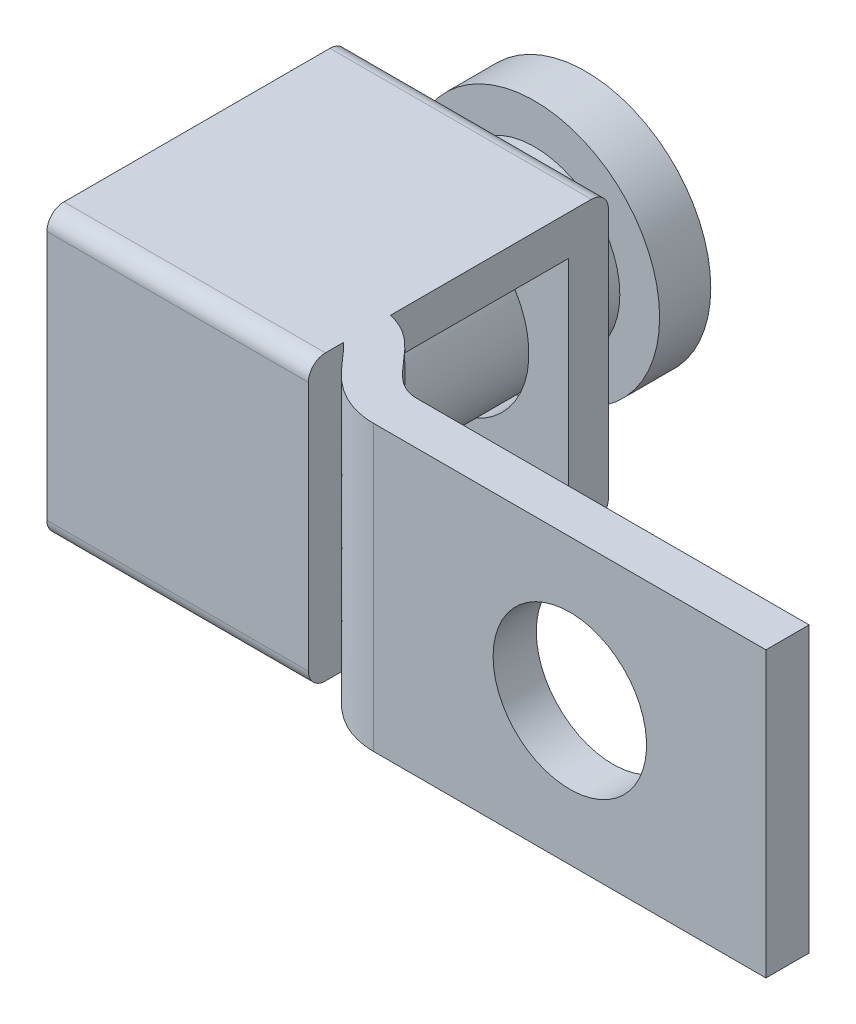
ISO-10303-21;
HEADER;
FILE_DESCRIPTION(('STEP AP214'),'2;1');
FILE_NAME('part.step','',(''),(''),'','','');
FILE_SCHEMA(('AUTOMOTIVE_DESIGN { 1 0 10303 214 1 1 1 1 }'));
ENDSEC;
DATA;
#1=APPLICATION_CONTEXT('core data for automotive mechanical design processes');
#2=APPLICATION_PROTOCOL_DEFINITION('international standard','automotive_design',2000,#1);
#3=PRODUCT_CONTEXT('',#1,'mechanical');
#4=PRODUCT('Part','Part','',(#3));
#5=PRODUCT_RELATED_PRODUCT_CATEGORY('part','',(#4));
#6=PRODUCT_DEFINITION_FORMATION('','',#4);
#7=PRODUCT_DEFINITION_CONTEXT('part definition',#1,'design');
#8=PRODUCT_DEFINITION('design','',#6,#7);
#9=PRODUCT_DEFINITION_SHAPE('','',#8);
#10=(LENGTH_UNIT() NAMED_UNIT(*) SI_UNIT(.MILLI.,.METRE.));
#11=(NAMED_UNIT(*) PLANE_ANGLE_UNIT() SI_UNIT($,.RADIAN.));
#12=(NAMED_UNIT(*) SI_UNIT($,.STERADIAN.) SOLID_ANGLE_UNIT());
#13=UNCERTAINTY_MEASURE_WITH_UNIT(LENGTH_MEASURE(1.E-05),#10,'distance_accuracy_value','');
#14=(GEOMETRIC_REPRESENTATION_CONTEXT(3) GLOBAL_UNCERTAINTY_ASSIGNED_CONTEXT((#13)) GLOBAL_UNIT_ASSIGNED_CONTEXT((#10,
#11,#12)) REPRESENTATION_CONTEXT('',''));
#15=CARTESIAN_POINT('',(0.,0.,0.));
#16=DIRECTION('',(0.,0.,1.));
#17=DIRECTION('',(1.,0.,0.));
#18=AXIS2_PLACEMENT_3D('',#15,#16,#17);
#19=CARTESIAN_POINT('',(-9.652,6.35,-5.5372));
#20=DIRECTION('',(0.,0.,1.));
#21=DIRECTION('',(-1.,0.,0.));
#22=AXIS2_PLACEMENT_3D('',#19,#20,#21);
#23=SPHERICAL_SURFACE('',#22,12.9286);
#24=CARTESIAN_POINT('',(-9.15256939804503,5.83881808976374,-5.5372));
#25=DIRECTION('',(0.698837366630695,-0.715280598786711,0.));
#26=DIRECTION('',(0.715280598786711,0.698837366630695,0.));
#27=AXIS2_PLACEMENT_3D('',#24,#25,#26);
#28=CIRCLE('',#27,12.9088326384874);
#29=CARTESIAN_POINT('',(-12.2827122705762,2.78063252464705,-17.6816500384057));
#30=VERTEX_POINT('',#29);
#31=CARTESIAN_POINT('',(-6.02242652551385,8.89700365488041,-17.6816500384057));
#32=VERTEX_POINT('',#31);
#33=EDGE_CURVE('E54',#30,#32,#28,.T.);
#34=ORIENTED_EDGE('',*,*,#33,.T.);
#35=CARTESIAN_POINT('',(-6.52185712746882,9.40818556511667,-5.5372));
#36=DIRECTION('',(0.715280598786711,0.698837366630695,0.));
#37=DIRECTION('',(-0.698837366630695,0.715280598786711,0.));
#38=AXIS2_PLACEMENT_3D('',#35,#36,#37);
#39=CIRCLE('',#38,12.1654594901653);
#40=CARTESIAN_POINT('',(-7.0212877294238,9.91936747535294,-17.6816500384057));
#41=VERTEX_POINT('',#40);
#42=EDGE_CURVE('E12',#32,#41,#39,.T.);
#43=ORIENTED_EDGE('',*,*,#42,.T.);
#44=CARTESIAN_POINT('',(-10.151430601955,6.86118191023626,-5.5372));
#45=DIRECTION('',(-0.698837366630695,0.715280598786711,0.));
#46=DIRECTION('',(-0.715280598786711,-0.698837366630695,0.));
#47=AXIS2_PLACEMENT_3D('',#44,#45,#46);
#48=CIRCLE('',#47,12.9088326384874);
#49=CARTESIAN_POINT('',(-13.2815734744862,3.80299634511958,-17.6816500384057));
#50=VERTEX_POINT('',#49);
#51=EDGE_CURVE('E88',#41,#50,#48,.T.);
#52=ORIENTED_EDGE('',*,*,#51,.T.);
#53=CARTESIAN_POINT('',(-12.7821428725312,3.29181443488332,-5.5372));
#54=DIRECTION('',(-0.715280598786711,-0.698837366630695,0.));
#55=DIRECTION('',(0.698837366630695,-0.715280598786711,0.));
#56=AXIS2_PLACEMENT_3D('',#53,#54,#55);
#57=CIRCLE('',#56,12.1654594901653);
#58=EDGE_CURVE('E125',#50,#30,#57,.T.);
#59=ORIENTED_EDGE('',*,*,#58,.T.);
#60=EDGE_LOOP('',(#34,#43,#52,#59));
#61=FACE_BOUND('',#60,.T.);
#62=CARTESIAN_POINT('',(-9.652,6.35,-17.1958));
#63=DIRECTION('',(0.,0.,1.));
#64=DIRECTION('',(1.,0.,0.));
#65=AXIS2_PLACEMENT_3D('',#62,#63,#64);
#66=CIRCLE('',#65,5.588);
#67=CARTESIAN_POINT('',(-4.06400000000001,6.35,-17.1958));
#68=VERTEX_POINT('',#67);
#69=EDGE_CURVE('E121',#68,#68,#66,.T.);
#70=ORIENTED_EDGE('',*,*,#69,.F.);
#71=EDGE_LOOP('',(#70));
#72=FACE_BOUND('',#71,.T.);
#73=ADVANCED_FACE('F47',(#61,#72),#23,.T.);
#74=CARTESIAN_POINT('',(-9.652,6.35,-10.8039232284796));
#75=DIRECTION('',(0.,0.,1.));
#76=DIRECTION('',(1.,0.,0.));
#77=AXIS2_PLACEMENT_3D('',#74,#75,#76);
#78=CYLINDRICAL_SURFACE('',#77,5.588);
#79=ORIENTED_EDGE('',*,*,#69,.T.);
#80=EDGE_LOOP('',(#79));
#81=FACE_BOUND('',#80,.T.);
#82=CARTESIAN_POINT('',(-9.652,6.35,-14.9098));
#83=DIRECTION('',(0.,0.,1.));
#84=DIRECTION('',(1.,0.,0.));
#85=AXIS2_PLACEMENT_3D('',#82,#83,#84);
#86=CIRCLE('',#85,5.588);
#87=CARTESIAN_POINT('',(-4.06400000000001,6.35,-14.9098));
#88=VERTEX_POINT('',#87);
#89=EDGE_CURVE('E118',#88,#88,#86,.T.);
#90=ORIENTED_EDGE('',*,*,#89,.F.);
#91=EDGE_LOOP('',(#90));
#92=FACE_BOUND('',#91,.T.);
#93=ADVANCED_FACE('F144',(#81,#92),#78,.T.);
#94=CARTESIAN_POINT('',(0.,6.35,-14.9098));
#95=DIRECTION('',(0.,0.,1.));
#96=DIRECTION('',(1.,0.,0.));
#97=AXIS2_PLACEMENT_3D('',#94,#95,#96);
#98=PLANE('',#97);
#99=ORIENTED_EDGE('',*,*,#89,.T.);
#100=EDGE_LOOP('',(#99));
#101=FACE_BOUND('',#100,.T.);
#102=CARTESIAN_POINT('',(-9.652,6.35,-14.9098));
#103=DIRECTION('',(0.,0.,1.));
#104=DIRECTION('',(1.,0.,0.));
#105=AXIS2_PLACEMENT_3D('',#102,#103,#104);
#106=CIRCLE('',#105,3.81);
#107=CARTESIAN_POINT('',(-5.842,6.35,-14.9098));
#108=VERTEX_POINT('',#107);
#109=EDGE_CURVE('E115',#108,#108,#106,.T.);
#110=ORIENTED_EDGE('',*,*,#109,.F.);
#111=EDGE_LOOP('',(#110));
#112=FACE_BOUND('',#111,.T.);
#113=ADVANCED_FACE('F148',(#101,#112),#98,.T.);
#114=CARTESIAN_POINT('',(-9.652,6.35,-10.8039232284796));
#115=DIRECTION('',(0.,0.,1.));
#116=DIRECTION('',(1.,0.,0.));
#117=AXIS2_PLACEMENT_3D('',#114,#115,#116);
#118=CYLINDRICAL_SURFACE('',#117,3.81);
#119=ORIENTED_EDGE('',*,*,#109,.T.);
#120=EDGE_LOOP('',(#119));
#121=FACE_BOUND('',#120,.T.);
#122=CARTESIAN_POINT('',(-9.652,6.35,-5.207));
#123=DIRECTION('',(0.,0.,1.));
#124=DIRECTION('',(1.,0.,0.));
#125=AXIS2_PLACEMENT_3D('',#122,#123,#124);
#126=CIRCLE('',#125,3.81);
#127=CARTESIAN_POINT('',(-5.842,6.35,-5.207));
#128=VERTEX_POINT('',#127);
#129=EDGE_CURVE('E109',#128,#128,#126,.T.);
#130=ORIENTED_EDGE('',*,*,#129,.F.);
#131=EDGE_LOOP('',(#130));
#132=FACE_BOUND('',#131,.T.);
#133=ADVANCED_FACE('F153',(#121,#132),#118,.T.);
#134=CARTESIAN_POINT('',(0.,6.35,-5.207));
#135=DIRECTION('',(0.,0.,1.));
#136=DIRECTION('',(1.,0.,0.));
#137=AXIS2_PLACEMENT_3D('',#134,#135,#136);
#138=PLANE('',#137);
#139=ORIENTED_EDGE('',*,*,#129,.T.);
#140=EDGE_LOOP('',(#139));
#141=FACE_BOUND('',#140,.T.);
#142=ADVANCED_FACE('F160',(#141),#138,.T.);
#143=CARTESIAN_POINT('',(-6.02242652551385,8.89700365488041,-19.7358));
#144=DIRECTION('',(0.715280598786711,0.698837366630695,0.));
#145=DIRECTION('',(-0.698837366630695,0.715280598786711,0.));
#146=AXIS2_PLACEMENT_3D('',#143,#144,#145);
#147=PLANE('',#146);
#148=DIRECTION('',(0.,0.,1.));
#149=VECTOR('',#148,1.);
#150=CARTESIAN_POINT('',(-6.02242652551385,8.89700365488041,-19.7358));
#151=LINE('',#150,#149);
#152=CARTESIAN_POINT('',(-6.02242652551385,8.89700365488041,-17.1958));
#153=VERTEX_POINT('',#152);
#154=EDGE_CURVE('E103',#32,#153,#151,.T.);
#155=ORIENTED_EDGE('',*,*,#154,.T.);
#156=DIRECTION('',(-0.698837366630695,0.715280598786711,0.));
#157=VECTOR('',#156,1.);
#158=CARTESIAN_POINT('',(-6.02242652551385,8.89700365488041,-17.1958));
#159=LINE('',#158,#157);
#160=CARTESIAN_POINT('',(-7.02128772942379,9.91936747535294,-17.1958));
#161=VERTEX_POINT('',#160);
#162=EDGE_CURVE('E97',#153,#161,#159,.T.);
#163=ORIENTED_EDGE('',*,*,#162,.T.);
#164=DIRECTION('',(0.,0.,1.));
#165=VECTOR('',#164,1.);
#166=CARTESIAN_POINT('',(-7.02128772942379,9.91936747535294,-19.7358));
#167=LINE('',#166,#165);
#168=EDGE_CURVE('E83',#41,#161,#167,.T.);
#169=ORIENTED_EDGE('',*,*,#168,.F.);
#170=ORIENTED_EDGE('',*,*,#42,.F.);
#171=EDGE_LOOP('',(#155,#163,#169,#170));
#172=FACE_BOUND('',#171,.T.);
#173=ADVANCED_FACE('F102',(#172),#147,.F.);
#174=CARTESIAN_POINT('',(-6.02242652551385,8.89700365488041,-19.7358));
#175=DIRECTION('',(0.698837366630695,-0.715280598786711,0.));
#176=DIRECTION('',(0.715280598786711,0.698837366630695,0.));
#177=AXIS2_PLACEMENT_3D('',#174,#175,#176);
#178=PLANE('',#177);
#179=DIRECTION('',(0.,0.,1.));
#180=VECTOR('',#179,1.);
#181=CARTESIAN_POINT('',(-12.2827122705762,2.78063252464705,-19.7358));
#182=LINE('',#181,#180);
#183=CARTESIAN_POINT('',(-12.2827122705762,2.78063252464705,-17.1958));
#184=VERTEX_POINT('',#183);
#185=EDGE_CURVE('E110',#30,#184,#182,.T.);
#186=ORIENTED_EDGE('',*,*,#185,.T.);
#187=DIRECTION('',(0.715280598786711,0.698837366630695,0.));
#188=VECTOR('',#187,1.);
#189=CARTESIAN_POINT('',(-6.02242652551385,8.89700365488041,-17.1958));
#190=LINE('',#189,#188);
#191=EDGE_CURVE('E90',#184,#153,#190,.T.);
#192=ORIENTED_EDGE('',*,*,#191,.T.);
#193=ORIENTED_EDGE('',*,*,#154,.F.);
#194=ORIENTED_EDGE('',*,*,#33,.F.);
#195=EDGE_LOOP('',(#186,#192,#193,#194));
#196=FACE_BOUND('',#195,.T.);
#197=ADVANCED_FACE('F132',(#196),#178,.F.);
#198=CARTESIAN_POINT('',(-12.2827122705762,2.78063252464705,-19.7358));
#199=DIRECTION('',(-0.715280598786711,-0.698837366630695,0.));
#200=DIRECTION('',(0.698837366630695,-0.715280598786711,0.));
#201=AXIS2_PLACEMENT_3D('',#198,#199,#200);
#202=PLANE('',#201);
#203=DIRECTION('',(0.,0.,1.));
#204=VECTOR('',#203,1.);
#205=CARTESIAN_POINT('',(-13.2815734744862,3.80299634511958,-19.7358));
#206=LINE('',#205,#204);
#207=CARTESIAN_POINT('',(-13.2815734744862,3.80299634511958,-17.1958));
#208=VERTEX_POINT('',#207);
#209=EDGE_CURVE('E61',#50,#208,#206,.T.);
#210=ORIENTED_EDGE('',*,*,#209,.T.);
#211=DIRECTION('',(0.698837366630694,-0.715280598786711,0.));
#212=VECTOR('',#211,1.);
#213=CARTESIAN_POINT('',(-12.2827122705762,2.78063252464705,-17.1958));
#214=LINE('',#213,#212);
#215=EDGE_CURVE('E100',#208,#184,#214,.T.);
#216=ORIENTED_EDGE('',*,*,#215,.T.);
#217=ORIENTED_EDGE('',*,*,#185,.F.);
#218=ORIENTED_EDGE('',*,*,#58,.F.);
#219=EDGE_LOOP('',(#210,#216,#217,#218));
#220=FACE_BOUND('',#219,.T.);
#221=ADVANCED_FACE('F134',(#220),#202,.F.);
#222=CARTESIAN_POINT('',(-7.02128772942379,9.91936747535294,-19.7358));
#223=DIRECTION('',(-0.698837366630695,0.715280598786711,0.));
#224=DIRECTION('',(-0.715280598786711,-0.698837366630695,0.));
#225=AXIS2_PLACEMENT_3D('',#222,#223,#224);
#226=PLANE('',#225);
#227=ORIENTED_EDGE('',*,*,#168,.T.);
#228=DIRECTION('',(-0.715280598786711,-0.698837366630695,0.));
#229=VECTOR('',#228,1.);
#230=CARTESIAN_POINT('',(-7.02128772942379,9.91936747535294,-17.1958));
#231=LINE('',#230,#229);
#232=EDGE_CURVE('E86',#161,#208,#231,.T.);
#233=ORIENTED_EDGE('',*,*,#232,.T.);
#234=ORIENTED_EDGE('',*,*,#209,.F.);
#235=ORIENTED_EDGE('',*,*,#51,.F.);
#236=EDGE_LOOP('',(#227,#233,#234,#235));
#237=FACE_BOUND('',#236,.T.);
#238=ADVANCED_FACE('F85',(#237),#226,.F.);
#239=CARTESIAN_POINT('',(0.,0.,-17.1958));
#240=DIRECTION('',(0.,0.,1.));
#241=DIRECTION('',(1.,0.,0.));
#242=AXIS2_PLACEMENT_3D('',#239,#240,#241);
#243=PLANE('',#242);
#244=ORIENTED_EDGE('',*,*,#162,.F.);
#245=ORIENTED_EDGE('',*,*,#191,.F.);
#246=ORIENTED_EDGE('',*,*,#215,.F.);
#247=ORIENTED_EDGE('',*,*,#232,.F.);
#248=EDGE_LOOP('',(#244,#245,#246,#247));
#249=FACE_BOUND('',#248,.T.);
#250=ADVANCED_FACE('F95',(#249),#243,.F.);
#251=CLOSED_SHELL('',(#73,#93,#113,#133,#142,#173,#197,#221,#238,#250));
#252=MANIFOLD_SOLID_BREP('B2',#251);
#253=CARTESIAN_POINT('',(-4.06400000000001,12.7,-2.667));
#254=CARTESIAN_POINT('',(-1.89990278656491,12.7,-2.40887158883268));
#255=CARTESIAN_POINT('',(-1.60244826873078,12.7,0.));
#256=CARTESIAN_POINT('',(0.,12.7,0.));
#257=B_SPLINE_CURVE_WITH_KNOTS('',3,(#253,#254,#255,#256),.UNSPECIFIED.,.F.,.F.,(4,4),(0.,1.),.UNSPECIFIED.);
#258=DIRECTION('',(0.,-1.,0.));
#259=VECTOR('',#258,1.);
#260=SURFACE_OF_LINEAR_EXTRUSION('',#257,#259);
#261=CARTESIAN_POINT('',(-4.06400000000001,0.,-2.667));
#262=CARTESIAN_POINT('',(-1.89990278656491,0.,-2.40887158883268));
#263=CARTESIAN_POINT('',(-1.60244826873078,0.,0.));
#264=CARTESIAN_POINT('',(0.,0.,0.));
#265=B_SPLINE_CURVE_WITH_KNOTS('',3,(#261,#262,#263,#264),.UNSPECIFIED.,.F.,.F.,(4,4),(0.,1.),.UNSPECIFIED.);
#266=CARTESIAN_POINT('',(-3.81,0.,-2.62534928328078));
#267=VERTEX_POINT('',#266);
#268=CARTESIAN_POINT('',(0.,0.,0.));
#269=VERTEX_POINT('',#268);
#270=EDGE_CURVE('E569',#267,#269,#265,.T.);
#271=ORIENTED_EDGE('',*,*,#270,.F.);
#272=DIRECTION('',(0.,-1.,0.));
#273=VECTOR('',#272,1.);
#274=CARTESIAN_POINT('',(-3.81,12.7,-2.62534928131849));
#275=LINE('',#274,#273);
#276=CARTESIAN_POINT('',(-3.81,1.778,-2.62534928328078));
#277=VERTEX_POINT('',#276);
#278=EDGE_CURVE('E423',#267,#277,#275,.F.);
#279=ORIENTED_EDGE('',*,*,#278,.T.);
#280=CARTESIAN_POINT('',(-4.06400000000001,1.778,-2.667));
#281=CARTESIAN_POINT('',(-1.89990278656491,1.778,-2.40887158883268));
#282=CARTESIAN_POINT('',(-1.60244826873078,1.778,0.));
#283=CARTESIAN_POINT('',(0.,1.778,0.));
#284=B_SPLINE_CURVE_WITH_KNOTS('',3,(#280,#281,#282,#283),.UNSPECIFIED.,.F.,.F.,(4,4),(0.,1.),.UNSPECIFIED.);
#285=CARTESIAN_POINT('',(-4.06400000000001,1.778,-2.667));
#286=VERTEX_POINT('',#285);
#287=EDGE_CURVE('E383',#277,#286,#284,.F.);
#288=ORIENTED_EDGE('',*,*,#287,.T.);
#289=DIRECTION('',(0.,-1.,0.));
#290=VECTOR('',#289,1.);
#291=CARTESIAN_POINT('',(-4.06400000000001,12.7,-2.667));
#292=LINE('',#291,#290);
#293=CARTESIAN_POINT('',(-4.06400000000001,10.922,-2.667));
#294=VERTEX_POINT('',#293);
#295=EDGE_CURVE('E550',#294,#286,#292,.T.);
#296=ORIENTED_EDGE('',*,*,#295,.F.);
#297=CARTESIAN_POINT('',(-4.06400000000001,10.922,-2.667));
#298=CARTESIAN_POINT('',(-1.89990278656491,10.922,-2.40887158883268));
#299=CARTESIAN_POINT('',(-1.60244826873078,10.922,0.));
#300=CARTESIAN_POINT('',(0.,10.922,0.));
#301=B_SPLINE_CURVE_WITH_KNOTS('',3,(#297,#298,#299,#300),.UNSPECIFIED.,.F.,.F.,(4,4),(0.,1.),.UNSPECIFIED.);
#302=CARTESIAN_POINT('',(-3.81,10.922,-2.62534928328078));
#303=VERTEX_POINT('',#302);
#304=EDGE_CURVE('E427',#294,#303,#301,.T.);
#305=ORIENTED_EDGE('',*,*,#304,.T.);
#306=CARTESIAN_POINT('',(-3.81,12.7,-2.62534928328078));
#307=VERTEX_POINT('',#306);
#308=EDGE_CURVE('E420',#303,#307,#275,.F.);
#309=ORIENTED_EDGE('',*,*,#308,.T.);
#310=CARTESIAN_POINT('',(0.,12.7,0.));
#311=VERTEX_POINT('',#310);
#312=EDGE_CURVE('E460',#307,#311,#257,.T.);
#313=ORIENTED_EDGE('',*,*,#312,.T.);
#314=DIRECTION('',(0.,-1.,0.));
#315=VECTOR('',#314,1.);
#316=CARTESIAN_POINT('',(0.,12.7,0.));
#317=LINE('',#316,#315);
#318=EDGE_CURVE('E547',#311,#269,#317,.T.);
#319=ORIENTED_EDGE('',*,*,#318,.T.);
#320=EDGE_LOOP('',(#271,#279,#288,#296,#305,#309,#313,#319));
#321=FACE_BOUND('',#320,.T.);
#322=ADVANCED_FACE('F234',(#321),#260,.T.);
#323=CARTESIAN_POINT('',(-15.494,12.7,-2.667));
#324=DIRECTION('',(0.,0.,-1.));
#325=DIRECTION('',(-1.,0.,0.));
#326=AXIS2_PLACEMENT_3D('',#323,#324,#325);
#327=PLANE('',#326);
#328=ORIENTED_EDGE('',*,*,#295,.T.);
#329=DIRECTION('',(-1.,0.,0.));
#330=VECTOR('',#329,1.);
#331=CARTESIAN_POINT('',(-15.494,1.778,-2.667));
#332=LINE('',#331,#330);
#333=CARTESIAN_POINT('',(-15.494,1.778,-2.667));
#334=VERTEX_POINT('',#333);
#335=EDGE_CURVE('E432',#286,#334,#332,.T.);
#336=ORIENTED_EDGE('',*,*,#335,.T.);
#337=DIRECTION('',(0.,-1.,0.));
#338=VECTOR('',#337,1.);
#339=CARTESIAN_POINT('',(-15.494,12.7,-2.667));
#340=LINE('',#339,#338);
#341=CARTESIAN_POINT('',(-15.494,10.922,-2.667));
#342=VERTEX_POINT('',#341);
#343=EDGE_CURVE('E553',#342,#334,#340,.T.);
#344=ORIENTED_EDGE('',*,*,#343,.F.);
#345=DIRECTION('',(1.,0.,0.));
#346=VECTOR('',#345,1.);
#347=CARTESIAN_POINT('',(-15.494,10.922,-2.667));
#348=LINE('',#347,#346);
#349=EDGE_CURVE('E424',#342,#294,#348,.T.);
#350=ORIENTED_EDGE('',*,*,#349,.T.);
#351=EDGE_LOOP('',(#328,#336,#344,#350));
#352=FACE_BOUND('',#351,.T.);
#353=ADVANCED_FACE('F474',(#352),#327,.T.);
#354=CARTESIAN_POINT('',(-4.20884166029546,12.7,-0.736599999999984));
#355=CARTESIAN_POINT('',(-4.13364475246318,12.7,-0.720873402253979));
#356=CARTESIAN_POINT('',(-4.08091764722321,12.7,-0.701195252116462));
#357=CARTESIAN_POINT('',(-3.96659914964292,12.7,-0.643669048456065));
#358=CARTESIAN_POINT('',(-3.90467372036856,12.7,-0.604208310034663));
#359=CARTESIAN_POINT('',(-3.75343510708307,12.7,-0.482014662267737));
#360=CARTESIAN_POINT('',(-3.66523662592699,12.7,-0.399083494241391));
#361=CARTESIAN_POINT('',(-3.46383226136667,12.7,-0.185573469730541));
#362=CARTESIAN_POINT('',(-3.35116983660942,12.7,-0.0554155103947658));
#363=CARTESIAN_POINT('',(-3.09452219515832,12.7,0.244365970775703));
#364=CARTESIAN_POINT('',(-2.95082149851627,12.7,0.414054000680158));
#365=CARTESIAN_POINT('',(-2.60623832854586,12.7,0.780981080871573));
#366=CARTESIAN_POINT('',(-2.40494496817286,12.7,0.97952680959493));
#367=CARTESIAN_POINT('',(-1.89734259380534,12.7,1.37103034480415));
#368=CARTESIAN_POINT('',(-1.58680767852259,12.7,1.56431585092809));
#369=CARTESIAN_POINT('',(-1.03351309697141,12.7,1.77674624108293));
#370=CARTESIAN_POINT('',(-0.835509504566746,12.7,1.8339977794622));
#371=CARTESIAN_POINT('',(-0.424705158929737,12.7,1.91086619655528));
#372=CARTESIAN_POINT('',(-0.212243475326851,12.7,1.9304));
#373=CARTESIAN_POINT('',(0.,12.7,1.9304));
#374=B_SPLINE_CURVE_WITH_KNOTS('',3,(#354,#355,#356,#357,#358,#359,#360,#361,#362,#363,#364,
#365,#366,#367,#368,#369,#370,#371,#372,#373),.UNSPECIFIED.,.F.,.F.,(4,2,2,2,2,2,2,2,2,4),(0.,
0.125,0.25,0.375,0.5,0.625,0.75,0.875,0.9375,1.),.UNSPECIFIED.);
#375=DIRECTION('',(0.,-1.,0.));
#376=VECTOR('',#375,1.);
#377=SURFACE_OF_LINEAR_EXTRUSION('',#374,#376);
#378=DIRECTION('',(0.,-1.,0.));
#379=VECTOR('',#378,1.);
#380=CARTESIAN_POINT('',(-3.81000000000597,12.7,-0.527474915905921));
#381=LINE('',#380,#379);
#382=CARTESIAN_POINT('',(-3.80999999505266,0.,-0.527474911779707));
#383=VERTEX_POINT('',#382);
#384=CARTESIAN_POINT('',(-3.81,12.7,-0.527474911779707));
#385=VERTEX_POINT('',#384);
#386=EDGE_CURVE('E413',#383,#385,#381,.F.);
#387=ORIENTED_EDGE('',*,*,#386,.F.);
#388=CARTESIAN_POINT('',(-4.20884166029546,0.,-0.736599999999984));
#389=CARTESIAN_POINT('',(-4.13364475246318,0.,-0.720873402253979));
#390=CARTESIAN_POINT('',(-4.08091764722321,0.,-0.701195252116462));
#391=CARTESIAN_POINT('',(-3.96659914964292,0.,-0.643669048456065));
#392=CARTESIAN_POINT('',(-3.90467372036856,0.,-0.604208310034663));
#393=CARTESIAN_POINT('',(-3.75343510708307,0.,-0.482014662267737));
#394=CARTESIAN_POINT('',(-3.66523662592699,0.,-0.399083494241391));
#395=CARTESIAN_POINT('',(-3.46383226136667,0.,-0.185573469730541));
#396=CARTESIAN_POINT('',(-3.35116983660942,0.,-0.0554155103947658));
#397=CARTESIAN_POINT('',(-3.09452219515832,0.,0.244365970775703));
#398=CARTESIAN_POINT('',(-2.95082149851627,0.,0.414054000680158));
#399=CARTESIAN_POINT('',(-2.60623832854586,0.,0.780981080871573));
#400=CARTESIAN_POINT('',(-2.40494496817286,0.,0.97952680959493));
#401=CARTESIAN_POINT('',(-1.89734259380534,0.,1.37103034480415));
#402=CARTESIAN_POINT('',(-1.58680767852259,0.,1.56431585092809));
#403=CARTESIAN_POINT('',(-1.03351309697141,0.,1.77674624108293));
#404=CARTESIAN_POINT('',(-0.835509504566746,0.,1.8339977794622));
#405=CARTESIAN_POINT('',(-0.424705158929737,0.,1.91086619655528));
#406=CARTESIAN_POINT('',(-0.212243475326851,0.,1.9304));
#407=CARTESIAN_POINT('',(0.,0.,1.9304));
#408=B_SPLINE_CURVE_WITH_KNOTS('',3,(#388,#389,#390,#391,#392,#393,#394,#395,#396,#397,#398,
#399,#400,#401,#402,#403,#404,#405,#406,#407),.UNSPECIFIED.,.F.,.F.,(4,2,2,2,2,2,2,2,2,4),(0.,
0.125,0.25,0.375,0.5,0.625,0.75,0.875,0.9375,1.),.UNSPECIFIED.);
#409=CARTESIAN_POINT('',(0.,0.,1.9304));
#410=VERTEX_POINT('',#409);
#411=EDGE_CURVE('E454',#383,#410,#408,.T.);
#412=ORIENTED_EDGE('',*,*,#411,.T.);
#413=DIRECTION('',(0.,-1.,0.));
#414=VECTOR('',#413,1.);
#415=CARTESIAN_POINT('',(0.,12.7,1.9304));
#416=LINE('',#415,#414);
#417=CARTESIAN_POINT('',(0.,12.7,1.9304));
#418=VERTEX_POINT('',#417);
#419=EDGE_CURVE('E556',#418,#410,#416,.T.);
#420=ORIENTED_EDGE('',*,*,#419,.F.);
#421=EDGE_CURVE('E559',#385,#418,#374,.T.);
#422=ORIENTED_EDGE('',*,*,#421,.F.);
#423=EDGE_LOOP('',(#387,#412,#420,#422));
#424=FACE_BOUND('',#423,.T.);
#425=ADVANCED_FACE('F489',(#424),#377,.F.);
#426=CARTESIAN_POINT('',(0.,12.7,1.9304));
#427=DIRECTION('',(0.,0.,-1.));
#428=DIRECTION('',(-1.,0.,0.));
#429=AXIS2_PLACEMENT_3D('',#426,#427,#428);
#430=PLANE('',#429);
#431=CARTESIAN_POINT('',(8.763,6.35,1.9304));
#432=DIRECTION('',(0.,0.,-1.));
#433=DIRECTION('',(-1.,0.,0.));
#434=AXIS2_PLACEMENT_3D('',#431,#432,#433);
#435=CIRCLE('',#434,3.429);
#436=CARTESIAN_POINT('',(5.334,6.35,1.9304));
#437=VERTEX_POINT('',#436);
#438=EDGE_CURVE('E447',#437,#437,#435,.T.);
#439=ORIENTED_EDGE('',*,*,#438,.T.);
#440=EDGE_LOOP('',(#439));
#441=FACE_BOUND('',#440,.T.);
#442=DIRECTION('',(1.,0.,0.));
#443=VECTOR('',#442,1.);
#444=CARTESIAN_POINT('',(0.,0.,1.9304));
#445=LINE('',#444,#443);
#446=CARTESIAN_POINT('',(17.526,0.,1.9304));
#447=VERTEX_POINT('',#446);
#448=EDGE_CURVE('E450',#410,#447,#445,.T.);
#449=ORIENTED_EDGE('',*,*,#448,.T.);
#450=DIRECTION('',(0.,-1.,0.));
#451=VECTOR('',#450,1.);
#452=CARTESIAN_POINT('',(17.526,12.7,1.9304));
#453=LINE('',#452,#451);
#454=CARTESIAN_POINT('',(17.526,12.7,1.9304));
#455=VERTEX_POINT('',#454);
#456=EDGE_CURVE('E540',#455,#447,#453,.T.);
#457=ORIENTED_EDGE('',*,*,#456,.F.);
#458=DIRECTION('',(1.,0.,0.));
#459=VECTOR('',#458,1.);
#460=CARTESIAN_POINT('',(0.,12.7,1.9304));
#461=LINE('',#460,#459);
#462=EDGE_CURVE('E451',#418,#455,#461,.T.);
#463=ORIENTED_EDGE('',*,*,#462,.F.);
#464=ORIENTED_EDGE('',*,*,#419,.T.);
#465=EDGE_LOOP('',(#449,#457,#463,#464));
#466=FACE_BOUND('',#465,.T.);
#467=ADVANCED_FACE('F485',(#441,#466),#430,.F.);
#468=CARTESIAN_POINT('',(17.526,12.7,0.));
#469=DIRECTION('',(1.,0.,0.));
#470=DIRECTION('',(0.,0.,-1.));
#471=AXIS2_PLACEMENT_3D('',#468,#469,#470);
#472=PLANE('',#471);
#473=DIRECTION('',(0.,0.,1.));
#474=VECTOR('',#473,1.);
#475=CARTESIAN_POINT('',(17.526,0.,0.));
#476=LINE('',#475,#474);
#477=CARTESIAN_POINT('',(17.526,0.,0.));
#478=VERTEX_POINT('',#477);
#479=EDGE_CURVE('E579',#478,#447,#476,.T.);
#480=ORIENTED_EDGE('',*,*,#479,.F.);
#481=DIRECTION('',(0.,-1.,0.));
#482=VECTOR('',#481,1.);
#483=CARTESIAN_POINT('',(17.526,12.7,0.));
#484=LINE('',#483,#482);
#485=CARTESIAN_POINT('',(17.526,12.7,0.));
#486=VERTEX_POINT('',#485);
#487=EDGE_CURVE('E545',#486,#478,#484,.T.);
#488=ORIENTED_EDGE('',*,*,#487,.F.);
#489=DIRECTION('',(0.,0.,1.));
#490=VECTOR('',#489,1.);
#491=CARTESIAN_POINT('',(17.526,12.7,0.));
#492=LINE('',#491,#490);
#493=EDGE_CURVE('E453',#486,#455,#492,.T.);
#494=ORIENTED_EDGE('',*,*,#493,.T.);
#495=ORIENTED_EDGE('',*,*,#456,.T.);
#496=EDGE_LOOP('',(#480,#488,#494,#495));
#497=FACE_BOUND('',#496,.T.);
#498=ADVANCED_FACE('F481',(#497),#472,.T.);
#499=CARTESIAN_POINT('',(0.,12.7,0.));
#500=DIRECTION('',(0.,0.,-1.));
#501=DIRECTION('',(-1.,0.,0.));
#502=AXIS2_PLACEMENT_3D('',#499,#500,#501);
#503=PLANE('',#502);
#504=CARTESIAN_POINT('',(8.763,6.35,0.));
#505=DIRECTION('',(0.,0.,-1.));
#506=DIRECTION('',(-1.,0.,0.));
#507=AXIS2_PLACEMENT_3D('',#504,#505,#506);
#508=CIRCLE('',#507,3.429);
#509=CARTESIAN_POINT('',(5.334,6.35,0.));
#510=VERTEX_POINT('',#509);
#511=EDGE_CURVE('E441',#510,#510,#508,.T.);
#512=ORIENTED_EDGE('',*,*,#511,.F.);
#513=EDGE_LOOP('',(#512));
#514=FACE_BOUND('',#513,.T.);
#515=DIRECTION('',(1.,0.,0.));
#516=VECTOR('',#515,1.);
#517=CARTESIAN_POINT('',(0.,0.,0.));
#518=LINE('',#517,#516);
#519=EDGE_CURVE('E573',#269,#478,#518,.T.);
#520=ORIENTED_EDGE('',*,*,#519,.F.);
#521=ORIENTED_EDGE('',*,*,#318,.F.);
#522=DIRECTION('',(1.,0.,0.));
#523=VECTOR('',#522,1.);
#524=CARTESIAN_POINT('',(0.,12.7,0.));
#525=LINE('',#524,#523);
#526=EDGE_CURVE('E457',#311,#486,#525,.T.);
#527=ORIENTED_EDGE('',*,*,#526,.T.);
#528=ORIENTED_EDGE('',*,*,#487,.T.);
#529=EDGE_LOOP('',(#520,#521,#527,#528));
#530=FACE_BOUND('',#529,.T.);
#531=ADVANCED_FACE('F477',(#514,#530),#503,.T.);
#532=CARTESIAN_POINT('',(-15.494,12.7,-0.7366));
#533=DIRECTION('',(-1.,0.,0.));
#534=DIRECTION('',(0.,0.,1.));
#535=AXIS2_PLACEMENT_3D('',#532,#533,#534);
#536=PLANE('',#535);
#537=ORIENTED_EDGE('',*,*,#343,.T.);
#538=DIRECTION('',(0.,0.,1.));
#539=VECTOR('',#538,1.);
#540=CARTESIAN_POINT('',(-15.494,1.778,-0.7366));
#541=LINE('',#540,#539);
#542=CARTESIAN_POINT('',(-15.494,1.778,-10.5918));
#543=VERTEX_POINT('',#542);
#544=EDGE_CURVE('E391',#543,#334,#541,.T.);
#545=ORIENTED_EDGE('',*,*,#544,.F.);
#546=DIRECTION('',(0.,-1.,0.));
#547=VECTOR('',#546,1.);
#548=CARTESIAN_POINT('',(-15.494,1.778,-10.5918));
#549=LINE('',#548,#547);
#550=CARTESIAN_POINT('',(-15.494,10.922,-10.5918));
#551=VERTEX_POINT('',#550);
#552=EDGE_CURVE('E373',#551,#543,#549,.T.);
#553=ORIENTED_EDGE('',*,*,#552,.F.);
#554=DIRECTION('',(0.,0.,-1.));
#555=VECTOR('',#554,1.);
#556=CARTESIAN_POINT('',(-15.494,10.922,-0.7366));
#557=LINE('',#556,#555);
#558=EDGE_CURVE('E395',#342,#551,#557,.T.);
#559=ORIENTED_EDGE('',*,*,#558,.F.);
#560=EDGE_LOOP('',(#537,#545,#553,#559));
#561=FACE_BOUND('',#560,.T.);
#562=DIRECTION('',(0.,0.,-1.));
#563=VECTOR('',#562,1.);
#564=CARTESIAN_POINT('',(-15.494,0.,-0.7366));
#565=LINE('',#564,#563);
#566=CARTESIAN_POINT('',(-15.494,0.,0.2794));
#567=VERTEX_POINT('',#566);
#568=CARTESIAN_POINT('',(-15.494,0.,-11.6078));
#569=VERTEX_POINT('',#568);
#570=EDGE_CURVE('E563',#567,#569,#565,.T.);
#571=ORIENTED_EDGE('',*,*,#570,.F.);
#572=CARTESIAN_POINT('',(-15.494,0.762,0.2794));
#573=DIRECTION('',(-1.,0.,0.));
#574=DIRECTION('',(0.,0.,1.));
#575=AXIS2_PLACEMENT_3D('',#572,#573,#574);
#576=CIRCLE('',#575,0.762);
#577=CARTESIAN_POINT('',(-15.494,0.762,1.0414));
#578=VERTEX_POINT('',#577);
#579=EDGE_CURVE('E529',#567,#578,#576,.T.);
#580=ORIENTED_EDGE('',*,*,#579,.T.);
#581=DIRECTION('',(0.,1.,0.));
#582=VECTOR('',#581,1.);
#583=CARTESIAN_POINT('',(-15.494,0.,1.0414));
#584=LINE('',#583,#582);
#585=CARTESIAN_POINT('',(-15.494,11.938,1.0414));
#586=VERTEX_POINT('',#585);
#587=EDGE_CURVE('E376',#578,#586,#584,.T.);
#588=ORIENTED_EDGE('',*,*,#587,.T.);
#589=CARTESIAN_POINT('',(-15.494,11.938,0.2794));
#590=DIRECTION('',(-1.,0.,0.));
#591=DIRECTION('',(0.,0.,1.));
#592=AXIS2_PLACEMENT_3D('',#589,#590,#591);
#593=CIRCLE('',#592,0.762);
#594=CARTESIAN_POINT('',(-15.494,12.7,0.2794));
#595=VERTEX_POINT('',#594);
#596=EDGE_CURVE('E531',#586,#595,#593,.T.);
#597=ORIENTED_EDGE('',*,*,#596,.T.);
#598=DIRECTION('',(0.,0.,-1.));
#599=VECTOR('',#598,1.);
#600=CARTESIAN_POINT('',(-15.494,12.7,-0.7366));
#601=LINE('',#600,#599);
#602=CARTESIAN_POINT('',(-15.494,12.7,-11.6078));
#603=VERTEX_POINT('',#602);
#604=EDGE_CURVE('E465',#595,#603,#601,.T.);
#605=ORIENTED_EDGE('',*,*,#604,.T.);
#606=CARTESIAN_POINT('',(-15.494,11.938,-11.6078));
#607=DIRECTION('',(-1.,0.,0.));
#608=DIRECTION('',(0.,0.,1.));
#609=AXIS2_PLACEMENT_3D('',#606,#607,#608);
#610=CIRCLE('',#609,0.762);
#611=CARTESIAN_POINT('',(-15.494,11.938,-12.3698));
#612=VERTEX_POINT('',#611);
#613=EDGE_CURVE('E534',#603,#612,#610,.T.);
#614=ORIENTED_EDGE('',*,*,#613,.T.);
#615=DIRECTION('',(0.,-1.,0.));
#616=VECTOR('',#615,1.);
#617=CARTESIAN_POINT('',(-15.494,0.,-12.3698));
#618=LINE('',#617,#616);
#619=CARTESIAN_POINT('',(-15.494,0.762,-12.3698));
#620=VERTEX_POINT('',#619);
#621=EDGE_CURVE('E405',#612,#620,#618,.T.);
#622=ORIENTED_EDGE('',*,*,#621,.T.);
#623=CARTESIAN_POINT('',(-15.494,0.762,-11.6078));
#624=DIRECTION('',(-1.,0.,0.));
#625=DIRECTION('',(0.,0.,1.));
#626=AXIS2_PLACEMENT_3D('',#623,#624,#625);
#627=CIRCLE('',#626,0.762);
#628=EDGE_CURVE('E511',#620,#569,#627,.T.);
#629=ORIENTED_EDGE('',*,*,#628,.T.);
#630=EDGE_LOOP('',(#571,#580,#588,#597,#605,#614,#622,#629));
#631=FACE_BOUND('',#630,.T.);
#632=ADVANCED_FACE('F480',(#561,#631),#536,.T.);
#633=CARTESIAN_POINT('',(-1.82138164573589,12.7,-1.23670184581225));
#634=DIRECTION('',(0.,1.,0.));
#635=DIRECTION('',(1.,0.,0.));
#636=AXIS2_PLACEMENT_3D('',#633,#634,#635);
#637=PLANE('',#636);
#638=ORIENTED_EDGE('',*,*,#604,.F.);
#639=DIRECTION('',(-1.,0.,0.));
#640=VECTOR('',#639,1.);
#641=CARTESIAN_POINT('',(-1.82138164573589,12.7,0.2794));
#642=LINE('',#641,#640);
#643=CARTESIAN_POINT('',(-3.81,12.7,0.2794));
#644=VERTEX_POINT('',#643);
#645=EDGE_CURVE('E513',#595,#644,#642,.F.);
#646=ORIENTED_EDGE('',*,*,#645,.T.);
#647=DIRECTION('',(0.,0.,-1.));
#648=VECTOR('',#647,1.);
#649=CARTESIAN_POINT('',(-3.81,12.7,1.0414));
#650=LINE('',#649,#648);
#651=EDGE_CURVE('E406',#644,#385,#650,.T.);
#652=ORIENTED_EDGE('',*,*,#651,.T.);
#653=ORIENTED_EDGE('',*,*,#421,.T.);
#654=ORIENTED_EDGE('',*,*,#462,.T.);
#655=ORIENTED_EDGE('',*,*,#493,.F.);
#656=ORIENTED_EDGE('',*,*,#526,.F.);
#657=ORIENTED_EDGE('',*,*,#312,.F.);
#658=CARTESIAN_POINT('',(-3.81,12.7,-11.6078));
#659=VERTEX_POINT('',#658);
#660=EDGE_CURVE('E404',#307,#659,#650,.T.);
#661=ORIENTED_EDGE('',*,*,#660,.T.);
#662=DIRECTION('',(-1.,0.,0.));
#663=VECTOR('',#662,1.);
#664=CARTESIAN_POINT('',(-1.82138164573589,12.7,-11.6078));
#665=LINE('',#664,#663);
#666=EDGE_CURVE('E517',#659,#603,#665,.T.);
#667=ORIENTED_EDGE('',*,*,#666,.T.);
#668=EDGE_LOOP('',(#638,#646,#652,#653,#654,#655,#656,#657,#661,#667));
#669=FACE_BOUND('',#668,.T.);
#670=ADVANCED_FACE('F596',(#669),#637,.T.);
#671=CARTESIAN_POINT('',(-1.82138164573589,0.,-1.23670184581225));
#672=DIRECTION('',(0.,1.,0.));
#673=DIRECTION('',(1.,0.,0.));
#674=AXIS2_PLACEMENT_3D('',#671,#672,#673);
#675=PLANE('',#674);
#676=DIRECTION('',(0.,0.,1.));
#677=VECTOR('',#676,1.);
#678=CARTESIAN_POINT('',(-3.81,0.,1.0414));
#679=LINE('',#678,#677);
#680=CARTESIAN_POINT('',(-3.81,0.,0.2794));
#681=VERTEX_POINT('',#680);
#682=EDGE_CURVE('E410',#383,#681,#679,.T.);
#683=ORIENTED_EDGE('',*,*,#682,.T.);
#684=DIRECTION('',(-1.,0.,0.));
#685=VECTOR('',#684,1.);
#686=CARTESIAN_POINT('',(-15.494,0.,0.2794));
#687=LINE('',#686,#685);
#688=EDGE_CURVE('E536',#681,#567,#687,.T.);
#689=ORIENTED_EDGE('',*,*,#688,.T.);
#690=ORIENTED_EDGE('',*,*,#570,.T.);
#691=DIRECTION('',(-1.,0.,0.));
#692=VECTOR('',#691,1.);
#693=CARTESIAN_POINT('',(-3.81,0.,-11.6078));
#694=LINE('',#693,#692);
#695=CARTESIAN_POINT('',(-3.81,0.,-11.6078));
#696=VERTEX_POINT('',#695);
#697=EDGE_CURVE('E508',#569,#696,#694,.F.);
#698=ORIENTED_EDGE('',*,*,#697,.T.);
#699=EDGE_CURVE('E411',#696,#267,#679,.T.);
#700=ORIENTED_EDGE('',*,*,#699,.T.);
#701=ORIENTED_EDGE('',*,*,#270,.T.);
#702=ORIENTED_EDGE('',*,*,#519,.T.);
#703=ORIENTED_EDGE('',*,*,#479,.T.);
#704=ORIENTED_EDGE('',*,*,#448,.F.);
#705=ORIENTED_EDGE('',*,*,#411,.F.);
#706=EDGE_LOOP('',(#683,#689,#690,#698,#700,#701,#702,#703,#704,#705));
#707=FACE_BOUND('',#706,.T.);
#708=ADVANCED_FACE('F593',(#707),#675,.F.);
#709=CARTESIAN_POINT('',(8.763,6.35,2.54));
#710=DIRECTION('',(0.,0.,-1.));
#711=DIRECTION('',(-1.,0.,0.));
#712=AXIS2_PLACEMENT_3D('',#709,#710,#711);
#713=CYLINDRICAL_SURFACE('',#712,3.429);
#714=ORIENTED_EDGE('',*,*,#511,.T.);
#715=EDGE_LOOP('',(#714));
#716=FACE_BOUND('',#715,.T.);
#717=ORIENTED_EDGE('',*,*,#438,.F.);
#718=EDGE_LOOP('',(#717));
#719=FACE_BOUND('',#718,.T.);
#720=ADVANCED_FACE('F643',(#716,#719),#713,.F.);
#721=CARTESIAN_POINT('',(-3.81,0.,1.0414));
#722=DIRECTION('',(0.,0.,1.));
#723=DIRECTION('',(1.,0.,0.));
#724=AXIS2_PLACEMENT_3D('',#721,#722,#723);
#725=PLANE('',#724);
#726=ORIENTED_EDGE('',*,*,#587,.F.);
#727=DIRECTION('',(-1.,0.,0.));
#728=VECTOR('',#727,1.);
#729=CARTESIAN_POINT('',(-3.81,0.762,1.0414));
#730=LINE('',#729,#728);
#731=CARTESIAN_POINT('',(-3.81,0.762,1.0414));
#732=VERTEX_POINT('',#731);
#733=EDGE_CURVE('E524',#578,#732,#730,.F.);
#734=ORIENTED_EDGE('',*,*,#733,.T.);
#735=DIRECTION('',(0.,1.,0.));
#736=VECTOR('',#735,1.);
#737=CARTESIAN_POINT('',(-3.81,0.,1.0414));
#738=LINE('',#737,#736);
#739=CARTESIAN_POINT('',(-3.81,11.938,1.0414));
#740=VERTEX_POINT('',#739);
#741=EDGE_CURVE('E401',#732,#740,#738,.T.);
#742=ORIENTED_EDGE('',*,*,#741,.T.);
#743=DIRECTION('',(-1.,0.,0.));
#744=VECTOR('',#743,1.);
#745=CARTESIAN_POINT('',(-3.81,11.938,1.0414));
#746=LINE('',#745,#744);
#747=EDGE_CURVE('E526',#740,#586,#746,.T.);
#748=ORIENTED_EDGE('',*,*,#747,.T.);
#749=EDGE_LOOP('',(#726,#734,#742,#748));
#750=FACE_BOUND('',#749,.T.);
#751=ADVANCED_FACE('F616',(#750),#725,.T.);
#752=CARTESIAN_POINT('',(-3.81,0.,0.));
#753=DIRECTION('',(-1.,0.,0.));
#754=DIRECTION('',(0.,0.,1.));
#755=AXIS2_PLACEMENT_3D('',#752,#753,#754);
#756=PLANE('',#755);
#757=ORIENTED_EDGE('',*,*,#741,.F.);
#758=CARTESIAN_POINT('',(-3.81,0.762,0.2794));
#759=DIRECTION('',(-1.,0.,0.));
#760=DIRECTION('',(0.,0.,1.));
#761=AXIS2_PLACEMENT_3D('',#758,#759,#760);
#762=CIRCLE('',#761,0.762);
#763=EDGE_CURVE('E520',#732,#681,#762,.F.);
#764=ORIENTED_EDGE('',*,*,#763,.T.);
#765=ORIENTED_EDGE('',*,*,#682,.F.);
#766=ORIENTED_EDGE('',*,*,#386,.T.);
#767=ORIENTED_EDGE('',*,*,#651,.F.);
#768=CARTESIAN_POINT('',(-3.81,11.938,0.2794));
#769=DIRECTION('',(-1.,0.,0.));
#770=DIRECTION('',(0.,0.,1.));
#771=AXIS2_PLACEMENT_3D('',#768,#769,#770);
#772=CIRCLE('',#771,0.762);
#773=EDGE_CURVE('E522',#644,#740,#772,.F.);
#774=ORIENTED_EDGE('',*,*,#773,.T.);
#775=EDGE_LOOP('',(#757,#764,#765,#766,#767,#774));
#776=FACE_BOUND('',#775,.T.);
#777=ADVANCED_FACE('F619',(#776),#756,.F.);
#778=CARTESIAN_POINT('',(-3.81,0.,-12.3698));
#779=DIRECTION('',(0.,0.,-1.));
#780=DIRECTION('',(-1.,0.,0.));
#781=AXIS2_PLACEMENT_3D('',#778,#779,#780);
#782=PLANE('',#781);
#783=CARTESIAN_POINT('',(-9.652,6.35,-12.3698));
#784=DIRECTION('',(0.,0.,-1.));
#785=DIRECTION('',(-1.,0.,0.));
#786=AXIS2_PLACEMENT_3D('',#783,#784,#785);
#787=CIRCLE('',#786,4.064);
#788=CARTESIAN_POINT('',(-13.716,6.35,-12.3698));
#789=VERTEX_POINT('',#788);
#790=EDGE_CURVE('E543',#789,#789,#787,.T.);
#791=ORIENTED_EDGE('',*,*,#790,.F.);
#792=EDGE_LOOP('',(#791));
#793=FACE_BOUND('',#792,.T.);
#794=DIRECTION('',(0.,-1.,0.));
#795=VECTOR('',#794,1.);
#796=CARTESIAN_POINT('',(-3.81,0.,-12.3698));
#797=LINE('',#796,#795);
#798=CARTESIAN_POINT('',(-3.81,11.938,-12.3698));
#799=VERTEX_POINT('',#798);
#800=CARTESIAN_POINT('',(-3.81,0.762,-12.3698));
#801=VERTEX_POINT('',#800);
#802=EDGE_CURVE('E408',#799,#801,#797,.T.);
#803=ORIENTED_EDGE('',*,*,#802,.T.);
#804=DIRECTION('',(-1.,0.,0.));
#805=VECTOR('',#804,1.);
#806=CARTESIAN_POINT('',(-15.494,0.762,-12.3698));
#807=LINE('',#806,#805);
#808=EDGE_CURVE('E510',#801,#620,#807,.T.);
#809=ORIENTED_EDGE('',*,*,#808,.T.);
#810=ORIENTED_EDGE('',*,*,#621,.F.);
#811=DIRECTION('',(-1.,0.,0.));
#812=VECTOR('',#811,1.);
#813=CARTESIAN_POINT('',(-3.81,11.938,-12.3698));
#814=LINE('',#813,#812);
#815=EDGE_CURVE('E254',#612,#799,#814,.F.);
#816=ORIENTED_EDGE('',*,*,#815,.T.);
#817=EDGE_LOOP('',(#803,#809,#810,#816));
#818=FACE_BOUND('',#817,.T.);
#819=ADVANCED_FACE('F629',(#793,#818),#782,.T.);
#820=ORIENTED_EDGE('',*,*,#699,.F.);
#821=CARTESIAN_POINT('',(-3.81,0.762,-11.6078));
#822=DIRECTION('',(-1.,0.,0.));
#823=DIRECTION('',(0.,0.,1.));
#824=AXIS2_PLACEMENT_3D('',#821,#822,#823);
#825=CIRCLE('',#824,0.762);
#826=EDGE_CURVE('E45',#696,#801,#825,.F.);
#827=ORIENTED_EDGE('',*,*,#826,.T.);
#828=ORIENTED_EDGE('',*,*,#802,.F.);
#829=CARTESIAN_POINT('',(-3.81,11.938,-11.6078));
#830=DIRECTION('',(-1.,0.,0.));
#831=DIRECTION('',(0.,0.,1.));
#832=AXIS2_PLACEMENT_3D('',#829,#830,#831);
#833=CIRCLE('',#832,0.762);
#834=EDGE_CURVE('E242',#799,#659,#833,.F.);
#835=ORIENTED_EDGE('',*,*,#834,.T.);
#836=ORIENTED_EDGE('',*,*,#660,.F.);
#837=ORIENTED_EDGE('',*,*,#308,.F.);
#838=DIRECTION('',(0.,0.,-1.));
#839=VECTOR('',#838,1.);
#840=CARTESIAN_POINT('',(-3.81,10.922,-0.7366));
#841=LINE('',#840,#839);
#842=CARTESIAN_POINT('',(-3.81,10.922,-10.5918));
#843=VERTEX_POINT('',#842);
#844=EDGE_CURVE('E389',#303,#843,#841,.T.);
#845=ORIENTED_EDGE('',*,*,#844,.T.);
#846=DIRECTION('',(0.,-1.,0.));
#847=VECTOR('',#846,1.);
#848=CARTESIAN_POINT('',(-3.81,1.778,-10.5918));
#849=LINE('',#848,#847);
#850=CARTESIAN_POINT('',(-3.81,1.778,-10.5918));
#851=VERTEX_POINT('',#850);
#852=EDGE_CURVE('E370',#843,#851,#849,.T.);
#853=ORIENTED_EDGE('',*,*,#852,.T.);
#854=DIRECTION('',(0.,0.,1.));
#855=VECTOR('',#854,1.);
#856=CARTESIAN_POINT('',(-3.81,1.778,-0.7366));
#857=LINE('',#856,#855);
#858=EDGE_CURVE('E380',#851,#277,#857,.T.);
#859=ORIENTED_EDGE('',*,*,#858,.T.);
#860=ORIENTED_EDGE('',*,*,#278,.F.);
#861=EDGE_LOOP('',(#820,#827,#828,#835,#836,#837,#845,#853,#859,#860));
#862=FACE_BOUND('',#861,.T.);
#863=ADVANCED_FACE('F387',(#862),#756,.F.);
#864=CARTESIAN_POINT('',(-3.81,1.778,-0.7366));
#865=DIRECTION('',(0.,-1.,0.));
#866=DIRECTION('',(0.,0.,-1.));
#867=AXIS2_PLACEMENT_3D('',#864,#865,#866);
#868=PLANE('',#867);
#869=ORIENTED_EDGE('',*,*,#287,.F.);
#870=ORIENTED_EDGE('',*,*,#858,.F.);
#871=DIRECTION('',(-1.,0.,0.));
#872=VECTOR('',#871,1.);
#873=CARTESIAN_POINT('',(-3.81,1.778,-10.5918));
#874=LINE('',#873,#872);
#875=EDGE_CURVE('E365',#851,#543,#874,.T.);
#876=ORIENTED_EDGE('',*,*,#875,.T.);
#877=ORIENTED_EDGE('',*,*,#544,.T.);
#878=ORIENTED_EDGE('',*,*,#335,.F.);
#879=EDGE_LOOP('',(#869,#870,#876,#877,#878));
#880=FACE_BOUND('',#879,.T.);
#881=ADVANCED_FACE('F381',(#880),#868,.F.);
#882=CARTESIAN_POINT('',(-3.81,1.778,-10.5918));
#883=DIRECTION('',(0.,0.,-1.));
#884=DIRECTION('',(-1.,0.,0.));
#885=AXIS2_PLACEMENT_3D('',#882,#883,#884);
#886=PLANE('',#885);
#887=CARTESIAN_POINT('',(-9.652,6.35,-10.5918));
#888=DIRECTION('',(0.,0.,-1.));
#889=DIRECTION('',(-1.,0.,0.));
#890=AXIS2_PLACEMENT_3D('',#887,#888,#889);
#891=CIRCLE('',#890,4.064);
#892=CARTESIAN_POINT('',(-13.716,6.35,-10.5918));
#893=VERTEX_POINT('',#892);
#894=EDGE_CURVE('E397',#893,#893,#891,.T.);
#895=ORIENTED_EDGE('',*,*,#894,.T.);
#896=EDGE_LOOP('',(#895));
#897=FACE_BOUND('',#896,.T.);
#898=ORIENTED_EDGE('',*,*,#552,.T.);
#899=ORIENTED_EDGE('',*,*,#875,.F.);
#900=ORIENTED_EDGE('',*,*,#852,.F.);
#901=DIRECTION('',(-1.,0.,0.));
#902=VECTOR('',#901,1.);
#903=CARTESIAN_POINT('',(-3.81,10.922,-10.5918));
#904=LINE('',#903,#902);
#905=EDGE_CURVE('E377',#843,#551,#904,.T.);
#906=ORIENTED_EDGE('',*,*,#905,.T.);
#907=EDGE_LOOP('',(#898,#899,#900,#906));
#908=FACE_BOUND('',#907,.T.);
#909=ADVANCED_FACE('F367',(#897,#908),#886,.F.);
#910=CARTESIAN_POINT('',(-3.81,10.922,-0.7366));
#911=DIRECTION('',(0.,1.,0.));
#912=DIRECTION('',(0.,0.,1.));
#913=AXIS2_PLACEMENT_3D('',#910,#911,#912);
#914=PLANE('',#913);
#915=ORIENTED_EDGE('',*,*,#304,.F.);
#916=ORIENTED_EDGE('',*,*,#349,.F.);
#917=ORIENTED_EDGE('',*,*,#558,.T.);
#918=ORIENTED_EDGE('',*,*,#905,.F.);
#919=ORIENTED_EDGE('',*,*,#844,.F.);
#920=EDGE_LOOP('',(#915,#916,#917,#918,#919));
#921=FACE_BOUND('',#920,.T.);
#922=ADVANCED_FACE('F666',(#921),#914,.F.);
#923=CARTESIAN_POINT('',(-9.652,6.35,-9.8298));
#924=DIRECTION('',(0.,0.,-1.));
#925=DIRECTION('',(-1.,0.,0.));
#926=AXIS2_PLACEMENT_3D('',#923,#924,#925);
#927=CYLINDRICAL_SURFACE('',#926,4.064);
#928=ORIENTED_EDGE('',*,*,#790,.T.);
#929=EDGE_LOOP('',(#928));
#930=FACE_BOUND('',#929,.T.);
#931=ORIENTED_EDGE('',*,*,#894,.F.);
#932=EDGE_LOOP('',(#931));
#933=FACE_BOUND('',#932,.T.);
#934=ADVANCED_FACE('F495',(#930,#933),#927,.F.);
#935=CARTESIAN_POINT('',(-1.82138164573589,0.762,0.2794));
#936=DIRECTION('',(1.,0.,0.));
#937=DIRECTION('',(0.,0.,-1.));
#938=AXIS2_PLACEMENT_3D('',#935,#936,#937);
#939=CYLINDRICAL_SURFACE('',#938,0.762);
#940=ORIENTED_EDGE('',*,*,#763,.F.);
#941=ORIENTED_EDGE('',*,*,#733,.F.);
#942=ORIENTED_EDGE('',*,*,#579,.F.);
#943=ORIENTED_EDGE('',*,*,#688,.F.);
#944=EDGE_LOOP('',(#940,#941,#942,#943));
#945=FACE_BOUND('',#944,.T.);
#946=ADVANCED_FACE('F491',(#945),#939,.T.);
#947=CARTESIAN_POINT('',(-3.81,11.938,0.2794));
#948=DIRECTION('',(-1.,0.,0.));
#949=DIRECTION('',(0.,0.,1.));
#950=AXIS2_PLACEMENT_3D('',#947,#948,#949);
#951=CYLINDRICAL_SURFACE('',#950,0.762);
#952=ORIENTED_EDGE('',*,*,#773,.F.);
#953=ORIENTED_EDGE('',*,*,#645,.F.);
#954=ORIENTED_EDGE('',*,*,#596,.F.);
#955=ORIENTED_EDGE('',*,*,#747,.F.);
#956=EDGE_LOOP('',(#952,#953,#954,#955));
#957=FACE_BOUND('',#956,.T.);
#958=ADVANCED_FACE('F494',(#957),#951,.T.);
#959=CARTESIAN_POINT('',(-3.81,0.762,-11.6078));
#960=DIRECTION('',(1.,0.,0.));
#961=DIRECTION('',(0.,0.,-1.));
#962=AXIS2_PLACEMENT_3D('',#959,#960,#961);
#963=CYLINDRICAL_SURFACE('',#962,0.762);
#964=ORIENTED_EDGE('',*,*,#826,.F.);
#965=ORIENTED_EDGE('',*,*,#697,.F.);
#966=ORIENTED_EDGE('',*,*,#628,.F.);
#967=ORIENTED_EDGE('',*,*,#808,.F.);
#968=EDGE_LOOP('',(#964,#965,#966,#967));
#969=FACE_BOUND('',#968,.T.);
#970=ADVANCED_FACE('F498',(#969),#963,.T.);
#971=CARTESIAN_POINT('',(-1.82138164573589,11.938,-11.6078));
#972=DIRECTION('',(-1.,0.,0.));
#973=DIRECTION('',(0.,0.,1.));
#974=AXIS2_PLACEMENT_3D('',#971,#972,#973);
#975=CYLINDRICAL_SURFACE('',#974,0.762);
#976=ORIENTED_EDGE('',*,*,#834,.F.);
#977=ORIENTED_EDGE('',*,*,#815,.F.);
#978=ORIENTED_EDGE('',*,*,#613,.F.);
#979=ORIENTED_EDGE('',*,*,#666,.F.);
#980=EDGE_LOOP('',(#976,#977,#978,#979));
#981=FACE_BOUND('',#980,.T.);
#982=ADVANCED_FACE('F236',(#981),#975,.T.);
#983=CLOSED_SHELL('',(#322,#353,#425,#467,#498,#531,#632,#670,#708,#720,#751,#777,#819,#863,
#881,#909,#922,#934,#946,#958,#970,#982));
#984=MANIFOLD_SOLID_BREP('B6',#983);
#985=ADVANCED_BREP_SHAPE_REPRESENTATION('',(#18,#252,#984),#14);
#986=SHAPE_DEFINITION_REPRESENTATION(#9,#985);
ENDSEC;
END-ISO-10303-21;
